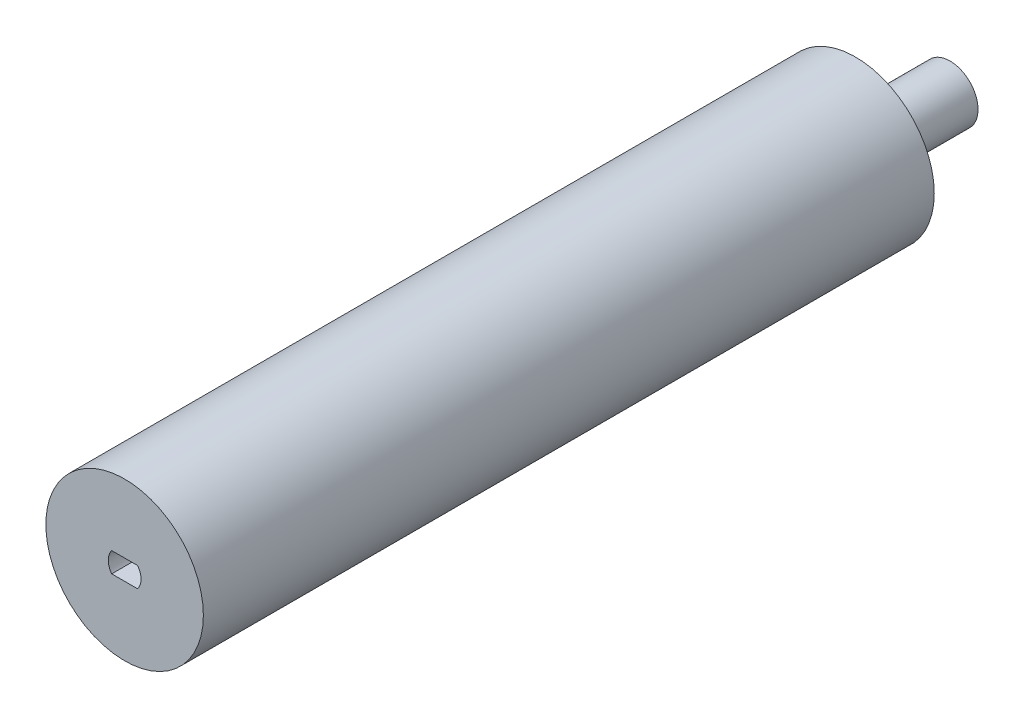
ISO-10303-21;
HEADER;
FILE_DESCRIPTION(('STEP AP214'),'2;1');
FILE_NAME('part.step','',(''),(''),'','','');
FILE_SCHEMA(('AUTOMOTIVE_DESIGN { 1 0 10303 214 1 1 1 1 }'));
ENDSEC;
DATA;
#1=APPLICATION_CONTEXT('core data for automotive mechanical design processes');
#2=APPLICATION_PROTOCOL_DEFINITION('international standard','automotive_design',2000,#1);
#3=PRODUCT_CONTEXT('',#1,'mechanical');
#4=PRODUCT('Part','Part','',(#3));
#5=PRODUCT_RELATED_PRODUCT_CATEGORY('part','',(#4));
#6=PRODUCT_DEFINITION_FORMATION('','',#4);
#7=PRODUCT_DEFINITION_CONTEXT('part definition',#1,'design');
#8=PRODUCT_DEFINITION('design','',#6,#7);
#9=PRODUCT_DEFINITION_SHAPE('','',#8);
#10=(LENGTH_UNIT() NAMED_UNIT(*) SI_UNIT(.MILLI.,.METRE.));
#11=(NAMED_UNIT(*) PLANE_ANGLE_UNIT() SI_UNIT($,.RADIAN.));
#12=(NAMED_UNIT(*) SI_UNIT($,.STERADIAN.) SOLID_ANGLE_UNIT());
#13=UNCERTAINTY_MEASURE_WITH_UNIT(LENGTH_MEASURE(1.E-05),#10,'distance_accuracy_value','');
#14=(GEOMETRIC_REPRESENTATION_CONTEXT(3) GLOBAL_UNCERTAINTY_ASSIGNED_CONTEXT((#13)) GLOBAL_UNIT_ASSIGNED_CONTEXT((#10,
#11,#12)) REPRESENTATION_CONTEXT('',''));
#15=CARTESIAN_POINT('',(0.,0.,0.));
#16=DIRECTION('',(0.,0.,1.));
#17=DIRECTION('',(1.,0.,0.));
#18=AXIS2_PLACEMENT_3D('',#15,#16,#17);
#19=CARTESIAN_POINT('',(0.,0.,-116.));
#20=DIRECTION('',(0.,0.,1.));
#21=DIRECTION('',(1.,0.,0.));
#22=AXIS2_PLACEMENT_3D('',#19,#20,#21);
#23=CYLINDRICAL_SURFACE('',#22,12.5);
#24=CARTESIAN_POINT('',(0.,0.,-116.));
#25=DIRECTION('',(0.,0.,1.));
#26=DIRECTION('',(1.,0.,0.));
#27=AXIS2_PLACEMENT_3D('',#24,#25,#26);
#28=CIRCLE('',#27,12.5);
#29=CARTESIAN_POINT('',(12.5,0.,-116.));
#30=VERTEX_POINT('',#29);
#31=EDGE_CURVE('E48',#30,#30,#28,.T.);
#32=ORIENTED_EDGE('',*,*,#31,.T.);
#33=EDGE_LOOP('',(#32));
#34=FACE_BOUND('',#33,.T.);
#35=CARTESIAN_POINT('',(0.,0.,0.));
#36=DIRECTION('',(0.,0.,1.));
#37=DIRECTION('',(1.,0.,0.));
#38=AXIS2_PLACEMENT_3D('',#35,#36,#37);
#39=CIRCLE('',#38,12.5);
#40=CARTESIAN_POINT('',(12.5,0.,0.));
#41=VERTEX_POINT('',#40);
#42=EDGE_CURVE('E42',#41,#41,#39,.T.);
#43=ORIENTED_EDGE('',*,*,#42,.F.);
#44=EDGE_LOOP('',(#43));
#45=FACE_BOUND('',#44,.T.);
#46=ADVANCED_FACE('F39',(#34,#45),#23,.T.);
#47=CARTESIAN_POINT('',(0.,0.,-116.));
#48=DIRECTION('',(0.,0.,1.));
#49=DIRECTION('',(1.,0.,0.));
#50=AXIS2_PLACEMENT_3D('',#47,#48,#49);
#51=PLANE('',#50);
#52=CARTESIAN_POINT('',(0.,0.,-116.));
#53=DIRECTION('',(0.,0.,-1.));
#54=DIRECTION('',(-1.,0.,0.));
#55=AXIS2_PLACEMENT_3D('',#52,#53,#54);
#56=CIRCLE('',#55,4.45);
#57=CARTESIAN_POINT('',(-4.45,0.,-116.));
#58=VERTEX_POINT('',#57);
#59=EDGE_CURVE('E11',#58,#58,#56,.T.);
#60=ORIENTED_EDGE('',*,*,#59,.F.);
#61=EDGE_LOOP('',(#60));
#62=FACE_BOUND('',#61,.T.);
#63=ORIENTED_EDGE('',*,*,#31,.F.);
#64=EDGE_LOOP('',(#63));
#65=FACE_BOUND('',#64,.T.);
#66=ADVANCED_FACE('F145',(#62,#65),#51,.F.);
#67=CARTESIAN_POINT('',(0.,0.,0.));
#68=DIRECTION('',(0.,0.,1.));
#69=DIRECTION('',(1.,0.,0.));
#70=AXIS2_PLACEMENT_3D('',#67,#68,#69);
#71=PLANE('',#70);
#72=CARTESIAN_POINT('',(0.00171414928473723,0.0325866269007807,0.));
#73=DIRECTION('',(0.,0.,1.));
#74=DIRECTION('',(1.,0.,0.));
#75=AXIS2_PLACEMENT_3D('',#72,#73,#74);
#76=CIRCLE('',#75,2.6);
#77=CARTESIAN_POINT('',(2.05110430247666,-1.56741337309922,0.));
#78=VERTEX_POINT('',#77);
#79=CARTESIAN_POINT('',(2.05110430247666,1.63258662690078,0.));
#80=VERTEX_POINT('',#79);
#81=EDGE_CURVE('E56',#78,#80,#76,.T.);
#82=ORIENTED_EDGE('',*,*,#81,.F.);
#83=DIRECTION('',(1.,0.,0.));
#84=VECTOR('',#83,1.);
#85=CARTESIAN_POINT('',(2.05110430247666,-1.56741337309922,0.));
#86=LINE('',#85,#84);
#87=CARTESIAN_POINT('',(-2.04767600390718,-1.56741337309922,0.));
#88=VERTEX_POINT('',#87);
#89=EDGE_CURVE('E111',#88,#78,#86,.T.);
#90=ORIENTED_EDGE('',*,*,#89,.F.);
#91=CARTESIAN_POINT('',(0.00171414928473723,0.0325866269007807,0.));
#92=DIRECTION('',(0.,0.,1.));
#93=DIRECTION('',(1.,0.,0.));
#94=AXIS2_PLACEMENT_3D('',#91,#92,#93);
#95=CIRCLE('',#94,2.6);
#96=CARTESIAN_POINT('',(-2.04767600390718,1.63258662690078,0.));
#97=VERTEX_POINT('',#96);
#98=EDGE_CURVE('E120',#97,#88,#95,.T.);
#99=ORIENTED_EDGE('',*,*,#98,.F.);
#100=DIRECTION('',(-1.,0.,0.));
#101=VECTOR('',#100,1.);
#102=CARTESIAN_POINT('',(2.05110430247666,1.63258662690078,0.));
#103=LINE('',#102,#101);
#104=EDGE_CURVE('E91',#80,#97,#103,.T.);
#105=ORIENTED_EDGE('',*,*,#104,.F.);
#106=EDGE_LOOP('',(#82,#90,#99,#105));
#107=FACE_BOUND('',#106,.T.);
#108=ORIENTED_EDGE('',*,*,#42,.T.);
#109=EDGE_LOOP('',(#108));
#110=FACE_BOUND('',#109,.T.);
#111=ADVANCED_FACE('F142',(#107,#110),#71,.T.);
#112=CARTESIAN_POINT('',(0.,0.,-131.));
#113=DIRECTION('',(0.,0.,1.));
#114=DIRECTION('',(1.,0.,0.));
#115=AXIS2_PLACEMENT_3D('',#112,#113,#114);
#116=CYLINDRICAL_SURFACE('',#115,4.45);
#117=CARTESIAN_POINT('',(0.,0.,-131.));
#118=DIRECTION('',(0.,0.,-1.));
#119=DIRECTION('',(-1.,0.,0.));
#120=AXIS2_PLACEMENT_3D('',#117,#118,#119);
#121=CIRCLE('',#120,4.45);
#122=CARTESIAN_POINT('',(-4.45,0.,-131.));
#123=VERTEX_POINT('',#122);
#124=EDGE_CURVE('E127',#123,#123,#121,.T.);
#125=ORIENTED_EDGE('',*,*,#124,.F.);
#126=EDGE_LOOP('',(#125));
#127=FACE_BOUND('',#126,.T.);
#128=ORIENTED_EDGE('',*,*,#59,.T.);
#129=EDGE_LOOP('',(#128));
#130=FACE_BOUND('',#129,.T.);
#131=ADVANCED_FACE('F154',(#127,#130),#116,.T.);
#132=CARTESIAN_POINT('',(0.,0.,-131.));
#133=DIRECTION('',(0.,0.,-1.));
#134=DIRECTION('',(-1.,0.,0.));
#135=AXIS2_PLACEMENT_3D('',#132,#133,#134);
#136=PLANE('',#135);
#137=ORIENTED_EDGE('',*,*,#124,.T.);
#138=EDGE_LOOP('',(#137));
#139=FACE_BOUND('',#138,.T.);
#140=ADVANCED_FACE('F161',(#139),#136,.T.);
#141=CARTESIAN_POINT('',(0.00171414928473723,0.0325866269007807,-10.));
#142=DIRECTION('',(0.,0.,1.));
#143=DIRECTION('',(1.,0.,0.));
#144=AXIS2_PLACEMENT_3D('',#141,#142,#143);
#145=CYLINDRICAL_SURFACE('',#144,2.6);
#146=ORIENTED_EDGE('',*,*,#81,.T.);
#147=DIRECTION('',(0.,0.,1.));
#148=VECTOR('',#147,1.);
#149=CARTESIAN_POINT('',(2.05110430247666,1.63258662690078,-10.));
#150=LINE('',#149,#148);
#151=CARTESIAN_POINT('',(2.05110430247666,1.63258662690078,-10.));
#152=VERTEX_POINT('',#151);
#153=EDGE_CURVE('E79',#152,#80,#150,.T.);
#154=ORIENTED_EDGE('',*,*,#153,.F.);
#155=CARTESIAN_POINT('',(0.00171414928473723,0.0325866269007807,-10.));
#156=DIRECTION('',(0.,0.,1.));
#157=DIRECTION('',(1.,0.,0.));
#158=AXIS2_PLACEMENT_3D('',#155,#156,#157);
#159=CIRCLE('',#158,2.6);
#160=CARTESIAN_POINT('',(2.05110430247666,-1.56741337309922,-10.));
#161=VERTEX_POINT('',#160);
#162=EDGE_CURVE('E107',#161,#152,#159,.T.);
#163=ORIENTED_EDGE('',*,*,#162,.F.);
#164=DIRECTION('',(0.,0.,1.));
#165=VECTOR('',#164,1.);
#166=CARTESIAN_POINT('',(2.05110430247666,-1.56741337309922,-10.));
#167=LINE('',#166,#165);
#168=EDGE_CURVE('E64',#161,#78,#167,.T.);
#169=ORIENTED_EDGE('',*,*,#168,.T.);
#170=EDGE_LOOP('',(#146,#154,#163,#169));
#171=FACE_BOUND('',#170,.T.);
#172=ADVANCED_FACE('F165',(#171),#145,.F.);
#173=CARTESIAN_POINT('',(2.05110430247666,-1.56741337309922,-10.));
#174=DIRECTION('',(0.,-1.,0.));
#175=DIRECTION('',(0.,0.,-1.));
#176=AXIS2_PLACEMENT_3D('',#173,#174,#175);
#177=PLANE('',#176);
#178=ORIENTED_EDGE('',*,*,#89,.T.);
#179=ORIENTED_EDGE('',*,*,#168,.F.);
#180=DIRECTION('',(1.,0.,0.));
#181=VECTOR('',#180,1.);
#182=CARTESIAN_POINT('',(2.05110430247666,-1.56741337309922,-10.));
#183=LINE('',#182,#181);
#184=CARTESIAN_POINT('',(-2.04767600390718,-1.56741337309922,-10.));
#185=VERTEX_POINT('',#184);
#186=EDGE_CURVE('E104',#185,#161,#183,.T.);
#187=ORIENTED_EDGE('',*,*,#186,.F.);
#188=DIRECTION('',(0.,0.,1.));
#189=VECTOR('',#188,1.);
#190=CARTESIAN_POINT('',(-2.04767600390718,-1.56741337309922,-10.));
#191=LINE('',#190,#189);
#192=EDGE_CURVE('E96',#185,#88,#191,.T.);
#193=ORIENTED_EDGE('',*,*,#192,.T.);
#194=EDGE_LOOP('',(#178,#179,#187,#193));
#195=FACE_BOUND('',#194,.T.);
#196=ADVANCED_FACE('F169',(#195),#177,.F.);
#197=CARTESIAN_POINT('',(0.00171414928473723,0.0325866269007807,-10.));
#198=DIRECTION('',(0.,0.,1.));
#199=DIRECTION('',(1.,0.,0.));
#200=AXIS2_PLACEMENT_3D('',#197,#198,#199);
#201=CYLINDRICAL_SURFACE('',#200,2.6);
#202=ORIENTED_EDGE('',*,*,#98,.T.);
#203=ORIENTED_EDGE('',*,*,#192,.F.);
#204=CARTESIAN_POINT('',(0.00171414928473723,0.0325866269007807,-10.));
#205=DIRECTION('',(0.,0.,1.));
#206=DIRECTION('',(1.,0.,0.));
#207=AXIS2_PLACEMENT_3D('',#204,#205,#206);
#208=CIRCLE('',#207,2.6);
#209=CARTESIAN_POINT('',(-2.04767600390718,1.63258662690078,-10.));
#210=VERTEX_POINT('',#209);
#211=EDGE_CURVE('E99',#210,#185,#208,.T.);
#212=ORIENTED_EDGE('',*,*,#211,.F.);
#213=DIRECTION('',(0.,0.,1.));
#214=VECTOR('',#213,1.);
#215=CARTESIAN_POINT('',(-2.04767600390718,1.63258662690078,-10.));
#216=LINE('',#215,#214);
#217=EDGE_CURVE('E84',#210,#97,#216,.T.);
#218=ORIENTED_EDGE('',*,*,#217,.T.);
#219=EDGE_LOOP('',(#202,#203,#212,#218));
#220=FACE_BOUND('',#219,.T.);
#221=ADVANCED_FACE('F100',(#220),#201,.F.);
#222=CARTESIAN_POINT('',(2.05110430247666,1.63258662690078,-10.));
#223=DIRECTION('',(0.,1.,0.));
#224=DIRECTION('',(0.,0.,1.));
#225=AXIS2_PLACEMENT_3D('',#222,#223,#224);
#226=PLANE('',#225);
#227=ORIENTED_EDGE('',*,*,#104,.T.);
#228=ORIENTED_EDGE('',*,*,#217,.F.);
#229=DIRECTION('',(-1.,0.,0.));
#230=VECTOR('',#229,1.);
#231=CARTESIAN_POINT('',(2.05110430247666,1.63258662690078,-10.));
#232=LINE('',#231,#230);
#233=EDGE_CURVE('E88',#152,#210,#232,.T.);
#234=ORIENTED_EDGE('',*,*,#233,.F.);
#235=ORIENTED_EDGE('',*,*,#153,.T.);
#236=EDGE_LOOP('',(#227,#228,#234,#235));
#237=FACE_BOUND('',#236,.T.);
#238=ADVANCED_FACE('F86',(#237),#226,.F.);
#239=CARTESIAN_POINT('',(0.00171414928473723,0.0325866269007807,-10.));
#240=DIRECTION('',(0.,0.,1.));
#241=DIRECTION('',(1.,0.,0.));
#242=AXIS2_PLACEMENT_3D('',#239,#240,#241);
#243=PLANE('',#242);
#244=ORIENTED_EDGE('',*,*,#162,.T.);
#245=ORIENTED_EDGE('',*,*,#233,.T.);
#246=ORIENTED_EDGE('',*,*,#211,.T.);
#247=ORIENTED_EDGE('',*,*,#186,.T.);
#248=EDGE_LOOP('',(#244,#245,#246,#247));
#249=FACE_BOUND('',#248,.T.);
#250=ADVANCED_FACE('F106',(#249),#243,.T.);
#251=CLOSED_SHELL('',(#46,#66,#111,#131,#140,#172,#196,#221,#238,#250));
#252=MANIFOLD_SOLID_BREP('B2',#251);
#253=ADVANCED_BREP_SHAPE_REPRESENTATION('',(#18,#252),#14);
#254=SHAPE_DEFINITION_REPRESENTATION(#9,#253);
ENDSEC;
END-ISO-10303-21;
